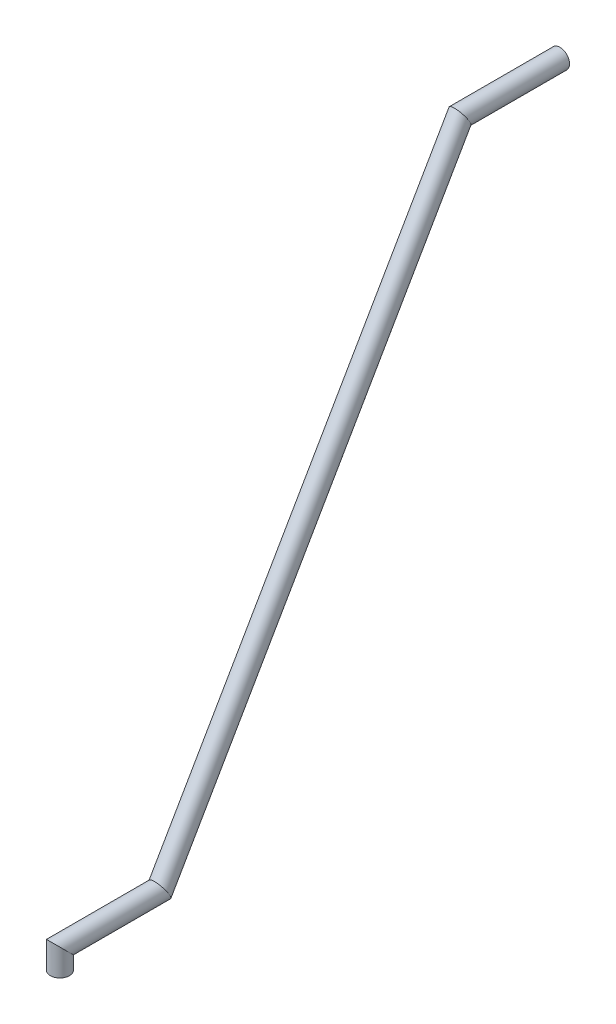
ISO-10303-21;
HEADER;
FILE_DESCRIPTION(('STEP AP214'),'2;1');
FILE_NAME('part.step','',(''),(''),'','','');
FILE_SCHEMA(('AUTOMOTIVE_DESIGN { 1 0 10303 214 1 1 1 1 }'));
ENDSEC;
DATA;
#1=APPLICATION_CONTEXT('core data for automotive mechanical design processes');
#2=APPLICATION_PROTOCOL_DEFINITION('international standard','automotive_design',2000,#1);
#3=PRODUCT_CONTEXT('',#1,'mechanical');
#4=PRODUCT('Part','Part','',(#3));
#5=PRODUCT_RELATED_PRODUCT_CATEGORY('part','',(#4));
#6=PRODUCT_DEFINITION_FORMATION('','',#4);
#7=PRODUCT_DEFINITION_CONTEXT('part definition',#1,'design');
#8=PRODUCT_DEFINITION('design','',#6,#7);
#9=PRODUCT_DEFINITION_SHAPE('','',#8);
#10=(LENGTH_UNIT() NAMED_UNIT(*) SI_UNIT(.MILLI.,.METRE.));
#11=(NAMED_UNIT(*) PLANE_ANGLE_UNIT() SI_UNIT($,.RADIAN.));
#12=(NAMED_UNIT(*) SI_UNIT($,.STERADIAN.) SOLID_ANGLE_UNIT());
#13=UNCERTAINTY_MEASURE_WITH_UNIT(LENGTH_MEASURE(1.E-05),#10,'distance_accuracy_value','');
#14=(GEOMETRIC_REPRESENTATION_CONTEXT(3) GLOBAL_UNCERTAINTY_ASSIGNED_CONTEXT((#13)) GLOBAL_UNIT_ASSIGNED_CONTEXT((#10,
#11,#12)) REPRESENTATION_CONTEXT('',''));
#15=CARTESIAN_POINT('',(0.,0.,0.));
#16=DIRECTION('',(0.,0.,1.));
#17=DIRECTION('',(1.,0.,0.));
#18=AXIS2_PLACEMENT_3D('',#15,#16,#17);
#19=CARTESIAN_POINT('',(0.,269.807621135332,-204.875406277282));
#20=DIRECTION('',(0.,0.,-1.));
#21=DIRECTION('',(-1.,0.,0.));
#22=AXIS2_PLACEMENT_3D('',#19,#20,#21);
#23=CYLINDRICAL_SURFACE('',#22,4.7625);
#24=CARTESIAN_POINT('',(0.,269.807621135332,-207.999999999999));
#25=DIRECTION('',(0.,0.500000000000001,-0.866025403784438));
#26=DIRECTION('',(0.,0.866025403784438,0.500000000000001));
#27=AXIS2_PLACEMENT_3D('',#24,#25,#26);
#28=ELLIPSE('',#27,5.49926131403119,4.7625);
#29=CARTESIAN_POINT('',(0.,274.570121135332,-205.250369342984));
#30=VERTEX_POINT('',#29);
#31=EDGE_CURVE('E46',#30,#30,#28,.F.);
#32=ORIENTED_EDGE('',*,*,#31,.F.);
#33=EDGE_LOOP('',(#32));
#34=FACE_BOUND('',#33,.T.);
#35=CARTESIAN_POINT('',(0.,269.807621135332,-257.999999999999));
#36=DIRECTION('',(0.,0.,-1.));
#37=DIRECTION('',(0.,1.,0.));
#38=AXIS2_PLACEMENT_3D('',#35,#36,#37);
#39=CIRCLE('',#38,4.7625);
#40=CARTESIAN_POINT('',(0.,274.570121135332,-257.999999999999));
#41=VERTEX_POINT('',#40);
#42=EDGE_CURVE('E75',#41,#41,#39,.T.);
#43=ORIENTED_EDGE('',*,*,#42,.F.);
#44=EDGE_LOOP('',(#43));
#45=FACE_BOUND('',#44,.T.);
#46=ADVANCED_FACE('F43',(#34,#45),#23,.T.);
#47=CARTESIAN_POINT('',(0.,7.29402245962153,-56.4377031386414));
#48=DIRECTION('',(0.,0.86602540378444,-0.499999999999998));
#49=DIRECTION('',(0.,0.499999999999998,0.86602540378444));
#50=AXIS2_PLACEMENT_3D('',#47,#48,#49);
#51=CYLINDRICAL_SURFACE('',#50,4.7625);
#52=CARTESIAN_POINT('',(0.,10.,-58.));
#53=DIRECTION('',(0.,0.500000000000001,-0.866025403784438));
#54=DIRECTION('',(0.,-0.866025403784438,-0.500000000000001));
#55=AXIS2_PLACEMENT_3D('',#52,#53,#54);
#56=ELLIPSE('',#55,5.49926131403119,4.7625);
#57=CARTESIAN_POINT('',(0.,5.2375,-60.7496306570156));
#58=VERTEX_POINT('',#57);
#59=EDGE_CURVE('E82',#58,#58,#56,.F.);
#60=ORIENTED_EDGE('',*,*,#59,.F.);
#61=EDGE_LOOP('',(#60));
#62=FACE_BOUND('',#61,.T.);
#63=ORIENTED_EDGE('',*,*,#31,.T.);
#64=EDGE_LOOP('',(#63));
#65=FACE_BOUND('',#64,.T.);
#66=ADVANCED_FACE('F91',(#62,#65),#51,.T.);
#67=CARTESIAN_POINT('',(0.,10.,-2.66125));
#68=DIRECTION('',(0.,0.,-1.));
#69=DIRECTION('',(-1.,0.,0.));
#70=AXIS2_PLACEMENT_3D('',#67,#68,#69);
#71=CYLINDRICAL_SURFACE('',#70,4.7625);
#72=CARTESIAN_POINT('',(0.,10.,-8.));
#73=DIRECTION('',(0.,0.707106781186547,-0.707106781186547));
#74=DIRECTION('',(0.,0.707106781186548,0.707106781186548));
#75=AXIS2_PLACEMENT_3D('',#72,#73,#74);
#76=ELLIPSE('',#75,6.73519209080187,4.7625);
#77=CARTESIAN_POINT('',(0.,14.7625,-3.2375));
#78=VERTEX_POINT('',#77);
#79=EDGE_CURVE('E79',#78,#78,#76,.F.);
#80=ORIENTED_EDGE('',*,*,#79,.F.);
#81=EDGE_LOOP('',(#80));
#82=FACE_BOUND('',#81,.T.);
#83=ORIENTED_EDGE('',*,*,#59,.T.);
#84=EDGE_LOOP('',(#83));
#85=FACE_BOUND('',#84,.T.);
#86=ADVANCED_FACE('F110',(#82,#85),#71,.T.);
#87=CARTESIAN_POINT('',(0.,0.,-8.));
#88=DIRECTION('',(0.,1.,0.));
#89=DIRECTION('',(0.,0.,1.));
#90=AXIS2_PLACEMENT_3D('',#87,#88,#89);
#91=CYLINDRICAL_SURFACE('',#90,4.7625);
#92=CARTESIAN_POINT('',(0.,0.,-8.));
#93=DIRECTION('',(0.,1.,0.));
#94=DIRECTION('',(0.,0.,1.));
#95=AXIS2_PLACEMENT_3D('',#92,#93,#94);
#96=CIRCLE('',#95,4.7625);
#97=CARTESIAN_POINT('',(0.,0.,-3.2375));
#98=VERTEX_POINT('',#97);
#99=EDGE_CURVE('E71',#98,#98,#96,.T.);
#100=ORIENTED_EDGE('',*,*,#99,.T.);
#101=EDGE_LOOP('',(#100));
#102=FACE_BOUND('',#101,.T.);
#103=ORIENTED_EDGE('',*,*,#79,.T.);
#104=EDGE_LOOP('',(#103));
#105=FACE_BOUND('',#104,.T.);
#106=ADVANCED_FACE('F100',(#102,#105),#91,.T.);
#107=CARTESIAN_POINT('',(0.,269.807621135332,-257.999999999999));
#108=DIRECTION('',(0.,0.,-1.));
#109=DIRECTION('',(0.,1.,0.));
#110=AXIS2_PLACEMENT_3D('',#107,#108,#109);
#111=PLANE('',#110);
#112=CARTESIAN_POINT('',(0.,269.807621135332,-257.999999999999));
#113=DIRECTION('',(0.,0.,-1.));
#114=DIRECTION('',(0.,1.,0.));
#115=AXIS2_PLACEMENT_3D('',#112,#113,#114);
#116=CIRCLE('',#115,3.175);
#117=CARTESIAN_POINT('',(0.,272.982621135332,-257.999999999999));
#118=VERTEX_POINT('',#117);
#119=EDGE_CURVE('E67',#118,#118,#116,.F.);
#120=ORIENTED_EDGE('',*,*,#119,.T.);
#121=EDGE_LOOP('',(#120));
#122=FACE_BOUND('',#121,.T.);
#123=ORIENTED_EDGE('',*,*,#42,.T.);
#124=EDGE_LOOP('',(#123));
#125=FACE_BOUND('',#124,.T.);
#126=ADVANCED_FACE('F97',(#122,#125),#111,.T.);
#127=CARTESIAN_POINT('',(0.,0.,-8.));
#128=DIRECTION('',(0.,1.,0.));
#129=DIRECTION('',(0.,0.,1.));
#130=AXIS2_PLACEMENT_3D('',#127,#128,#129);
#131=PLANE('',#130);
#132=CARTESIAN_POINT('',(0.,0.,-8.));
#133=DIRECTION('',(0.,1.,0.));
#134=DIRECTION('',(0.,0.,1.));
#135=AXIS2_PLACEMENT_3D('',#132,#133,#134);
#136=CIRCLE('',#135,3.175);
#137=CARTESIAN_POINT('',(0.,0.,-4.825));
#138=VERTEX_POINT('',#137);
#139=EDGE_CURVE('E51',#138,#138,#136,.F.);
#140=ORIENTED_EDGE('',*,*,#139,.F.);
#141=EDGE_LOOP('',(#140));
#142=FACE_BOUND('',#141,.T.);
#143=ORIENTED_EDGE('',*,*,#99,.F.);
#144=EDGE_LOOP('',(#143));
#145=FACE_BOUND('',#144,.T.);
#146=ADVANCED_FACE('F99',(#142,#145),#131,.F.);
#147=CARTESIAN_POINT('',(0.,269.807621135332,-205.883604184855));
#148=DIRECTION('',(0.,0.,-1.));
#149=DIRECTION('',(-1.,0.,0.));
#150=AXIS2_PLACEMENT_3D('',#147,#148,#149);
#151=CYLINDRICAL_SURFACE('',#150,3.175);
#152=CARTESIAN_POINT('',(0.,269.807621135332,-207.999999999999));
#153=DIRECTION('',(0.,0.500000000000001,-0.866025403784438));
#154=DIRECTION('',(0.,0.866025403784438,0.500000000000001));
#155=AXIS2_PLACEMENT_3D('',#152,#153,#154);
#156=ELLIPSE('',#155,3.66617420935413,3.175);
#157=CARTESIAN_POINT('',(0.,272.982621135332,-206.166912895322));
#158=VERTEX_POINT('',#157);
#159=EDGE_CURVE('E63',#158,#158,#156,.T.);
#160=ORIENTED_EDGE('',*,*,#159,.F.);
#161=EDGE_LOOP('',(#160));
#162=FACE_BOUND('',#161,.T.);
#163=ORIENTED_EDGE('',*,*,#119,.F.);
#164=EDGE_LOOP('',(#163));
#165=FACE_BOUND('',#164,.T.);
#166=ADVANCED_FACE('F107',(#162,#165),#151,.F.);
#167=CARTESIAN_POINT('',(0.,8.16714745962154,-56.9418020924276));
#168=DIRECTION('',(0.,0.86602540378444,-0.499999999999998));
#169=DIRECTION('',(0.,0.499999999999998,0.86602540378444));
#170=AXIS2_PLACEMENT_3D('',#167,#168,#169);
#171=CYLINDRICAL_SURFACE('',#170,3.175);
#172=CARTESIAN_POINT('',(0.,10.,-58.));
#173=DIRECTION('',(0.,0.500000000000001,-0.866025403784438));
#174=DIRECTION('',(0.,-0.866025403784438,-0.500000000000001));
#175=AXIS2_PLACEMENT_3D('',#172,#173,#174);
#176=ELLIPSE('',#175,3.66617420935413,3.175);
#177=CARTESIAN_POINT('',(0.,6.825,-59.8330871046771));
#178=VERTEX_POINT('',#177);
#179=EDGE_CURVE('E57',#178,#178,#176,.T.);
#180=ORIENTED_EDGE('',*,*,#179,.F.);
#181=EDGE_LOOP('',(#180));
#182=FACE_BOUND('',#181,.T.);
#183=ORIENTED_EDGE('',*,*,#159,.T.);
#184=EDGE_LOOP('',(#183));
#185=FACE_BOUND('',#184,.T.);
#186=ADVANCED_FACE('F121',(#182,#185),#171,.F.);
#187=CARTESIAN_POINT('',(0.,10.,-4.4075));
#188=DIRECTION('',(0.,0.,-1.));
#189=DIRECTION('',(-1.,0.,0.));
#190=AXIS2_PLACEMENT_3D('',#187,#188,#189);
#191=CYLINDRICAL_SURFACE('',#190,3.175);
#192=CARTESIAN_POINT('',(0.,10.,-8.));
#193=DIRECTION('',(0.,0.707106781186548,-0.707106781186548));
#194=DIRECTION('',(0.,0.707106781186548,0.707106781186548));
#195=AXIS2_PLACEMENT_3D('',#192,#193,#194);
#196=ELLIPSE('',#195,4.49012806053458,3.175);
#197=CARTESIAN_POINT('',(0.,13.175,-4.825));
#198=VERTEX_POINT('',#197);
#199=EDGE_CURVE('E10',#198,#198,#196,.T.);
#200=ORIENTED_EDGE('',*,*,#199,.F.);
#201=EDGE_LOOP('',(#200));
#202=FACE_BOUND('',#201,.T.);
#203=ORIENTED_EDGE('',*,*,#179,.T.);
#204=EDGE_LOOP('',(#203));
#205=FACE_BOUND('',#204,.T.);
#206=ADVANCED_FACE('F115',(#202,#205),#191,.F.);
#207=CARTESIAN_POINT('',(0.,0.,-8.));
#208=DIRECTION('',(0.,1.,0.));
#209=DIRECTION('',(0.,0.,1.));
#210=AXIS2_PLACEMENT_3D('',#207,#208,#209);
#211=CYLINDRICAL_SURFACE('',#210,3.175);
#212=ORIENTED_EDGE('',*,*,#139,.T.);
#213=EDGE_LOOP('',(#212));
#214=FACE_BOUND('',#213,.T.);
#215=ORIENTED_EDGE('',*,*,#199,.T.);
#216=EDGE_LOOP('',(#215));
#217=FACE_BOUND('',#216,.T.);
#218=ADVANCED_FACE('F113',(#214,#217),#211,.F.);
#219=CLOSED_SHELL('',(#46,#66,#86,#106,#126,#146,#166,#186,#206,#218));
#220=MANIFOLD_SOLID_BREP('B2',#219);
#221=ADVANCED_BREP_SHAPE_REPRESENTATION('',(#18,#220),#14);
#222=SHAPE_DEFINITION_REPRESENTATION(#9,#221);
ENDSEC;
END-ISO-10303-21;
